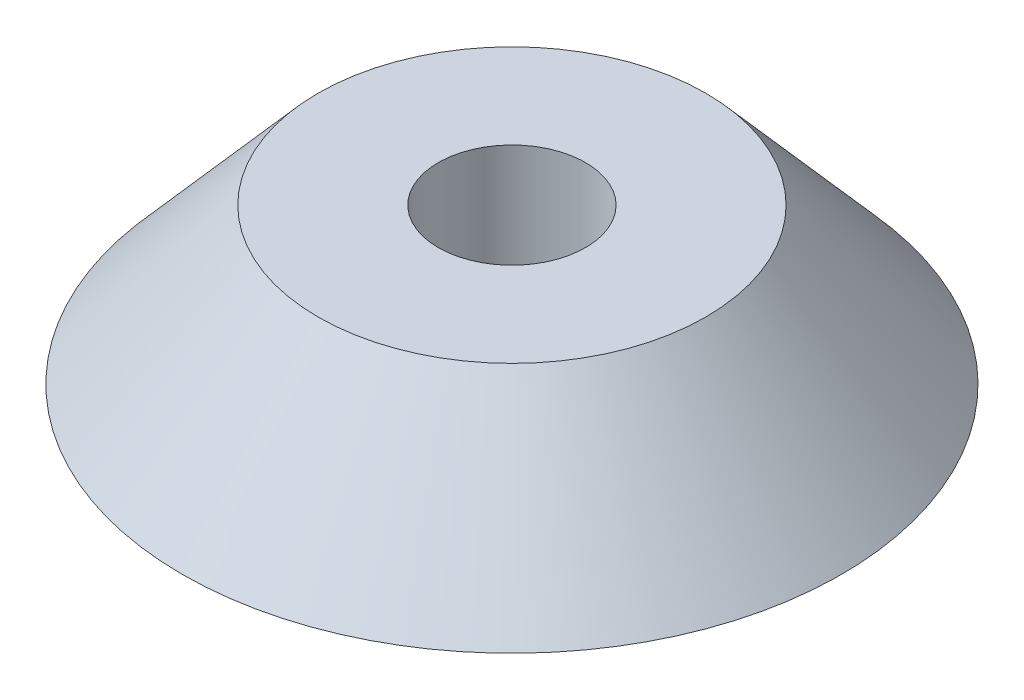
ISO-10303-21;
HEADER;
FILE_DESCRIPTION(('STEP AP214'),'2;1');
FILE_NAME('part.step','',(''),(''),'','','');
FILE_SCHEMA(('AUTOMOTIVE_DESIGN { 1 0 10303 214 1 1 1 1 }'));
ENDSEC;
DATA;
#1=APPLICATION_CONTEXT('core data for automotive mechanical design processes');
#2=APPLICATION_PROTOCOL_DEFINITION('international standard','automotive_design',2000,#1);
#3=PRODUCT_CONTEXT('',#1,'mechanical');
#4=PRODUCT('Part','Part','',(#3));
#5=PRODUCT_RELATED_PRODUCT_CATEGORY('part','',(#4));
#6=PRODUCT_DEFINITION_FORMATION('','',#4);
#7=PRODUCT_DEFINITION_CONTEXT('part definition',#1,'design');
#8=PRODUCT_DEFINITION('design','',#6,#7);
#9=PRODUCT_DEFINITION_SHAPE('','',#8);
#10=(LENGTH_UNIT() NAMED_UNIT(*) SI_UNIT(.MILLI.,.METRE.));
#11=(NAMED_UNIT(*) PLANE_ANGLE_UNIT() SI_UNIT($,.RADIAN.));
#12=(NAMED_UNIT(*) SI_UNIT($,.STERADIAN.) SOLID_ANGLE_UNIT());
#13=UNCERTAINTY_MEASURE_WITH_UNIT(LENGTH_MEASURE(1.E-05),#10,'distance_accuracy_value','');
#14=(GEOMETRIC_REPRESENTATION_CONTEXT(3) GLOBAL_UNCERTAINTY_ASSIGNED_CONTEXT((#13)) GLOBAL_UNIT_ASSIGNED_CONTEXT((#10,
#11,#12)) REPRESENTATION_CONTEXT('',''));
#15=CARTESIAN_POINT('',(0.,0.,0.));
#16=DIRECTION('',(0.,0.,1.));
#17=DIRECTION('',(1.,0.,0.));
#18=AXIS2_PLACEMENT_3D('',#15,#16,#17);
#19=CARTESIAN_POINT('',(0.,5.08,0.));
#20=DIRECTION('',(0.,1.,0.));
#21=DIRECTION('',(0.,0.,1.));
#22=AXIS2_PLACEMENT_3D('',#19,#20,#21);
#23=PLANE('',#22);
#24=CARTESIAN_POINT('',(0.,5.08,0.));
#25=DIRECTION('',(0.,1.,0.));
#26=DIRECTION('',(0.,0.,1.));
#27=AXIS2_PLACEMENT_3D('',#24,#25,#26);
#28=CIRCLE('',#27,2.413);
#29=CARTESIAN_POINT('',(0.,5.08,2.413));
#30=VERTEX_POINT('',#29);
#31=EDGE_CURVE('E46',#30,#30,#28,.F.);
#32=ORIENTED_EDGE('',*,*,#31,.T.);
#33=EDGE_LOOP('',(#32));
#34=FACE_BOUND('',#33,.T.);
#35=CARTESIAN_POINT('',(0.,5.08,0.));
#36=DIRECTION('',(0.,1.,0.));
#37=DIRECTION('',(0.,0.,1.));
#38=AXIS2_PLACEMENT_3D('',#35,#36,#37);
#39=CIRCLE('',#38,6.35);
#40=CARTESIAN_POINT('',(0.,5.08,6.35));
#41=VERTEX_POINT('',#40);
#42=EDGE_CURVE('E11',#41,#41,#39,.T.);
#43=ORIENTED_EDGE('',*,*,#42,.T.);
#44=EDGE_LOOP('',(#43));
#45=FACE_BOUND('',#44,.T.);
#46=ADVANCED_FACE('F33',(#34,#45),#23,.T.);
#47=CARTESIAN_POINT('',(0.,0.,0.));
#48=DIRECTION('',(0.,1.,0.));
#49=DIRECTION('',(0.,0.,1.));
#50=AXIS2_PLACEMENT_3D('',#47,#48,#49);
#51=PLANE('',#50);
#52=CARTESIAN_POINT('',(0.,0.,0.));
#53=DIRECTION('',(0.,1.,0.));
#54=DIRECTION('',(0.,0.,1.));
#55=AXIS2_PLACEMENT_3D('',#52,#53,#54);
#56=CIRCLE('',#55,2.413);
#57=CARTESIAN_POINT('',(0.,0.,2.413));
#58=VERTEX_POINT('',#57);
#59=EDGE_CURVE('E102',#58,#58,#56,.T.);
#60=ORIENTED_EDGE('',*,*,#59,.T.);
#61=EDGE_LOOP('',(#60));
#62=FACE_BOUND('',#61,.T.);
#63=CARTESIAN_POINT('',(0.,0.,0.));
#64=DIRECTION('',(0.,1.,0.));
#65=DIRECTION('',(0.,0.,1.));
#66=AXIS2_PLACEMENT_3D('',#63,#64,#65);
#67=CIRCLE('',#66,10.795);
#68=CARTESIAN_POINT('',(0.,0.,10.795));
#69=VERTEX_POINT('',#68);
#70=EDGE_CURVE('E41',#69,#69,#67,.T.);
#71=ORIENTED_EDGE('',*,*,#70,.F.);
#72=EDGE_LOOP('',(#71));
#73=FACE_BOUND('',#72,.T.);
#74=ADVANCED_FACE('F65',(#62,#73),#51,.F.);
#75=CARTESIAN_POINT('',(0.,5.08,0.));
#76=DIRECTION('',(0.,-1.,0.));
#77=DIRECTION('',(0.,0.,-1.));
#78=AXIS2_PLACEMENT_3D('',#75,#76,#77);
#79=CONICAL_SURFACE('',#78,6.35,0.718829999621624);
#80=ORIENTED_EDGE('',*,*,#70,.T.);
#81=EDGE_LOOP('',(#80));
#82=FACE_BOUND('',#81,.T.);
#83=ORIENTED_EDGE('',*,*,#42,.F.);
#84=EDGE_LOOP('',(#83));
#85=FACE_BOUND('',#84,.T.);
#86=ADVANCED_FACE('F74',(#82,#85),#79,.T.);
#87=CARTESIAN_POINT('',(0.,5.0801,0.));
#88=DIRECTION('',(0.,-1.,0.));
#89=DIRECTION('',(0.,0.,-1.));
#90=AXIS2_PLACEMENT_3D('',#87,#88,#89);
#91=CYLINDRICAL_SURFACE('',#90,2.413);
#92=ORIENTED_EDGE('',*,*,#31,.F.);
#93=EDGE_LOOP('',(#92));
#94=FACE_BOUND('',#93,.T.);
#95=ORIENTED_EDGE('',*,*,#59,.F.);
#96=EDGE_LOOP('',(#95));
#97=FACE_BOUND('',#96,.T.);
#98=ADVANCED_FACE('F76',(#94,#97),#91,.F.);
#99=CLOSED_SHELL('',(#46,#74,#86,#98));
#100=MANIFOLD_SOLID_BREP('B2',#99);
#101=ADVANCED_BREP_SHAPE_REPRESENTATION('',(#18,#100),#14);
#102=SHAPE_DEFINITION_REPRESENTATION(#9,#101);
ENDSEC;
END-ISO-10303-21;
